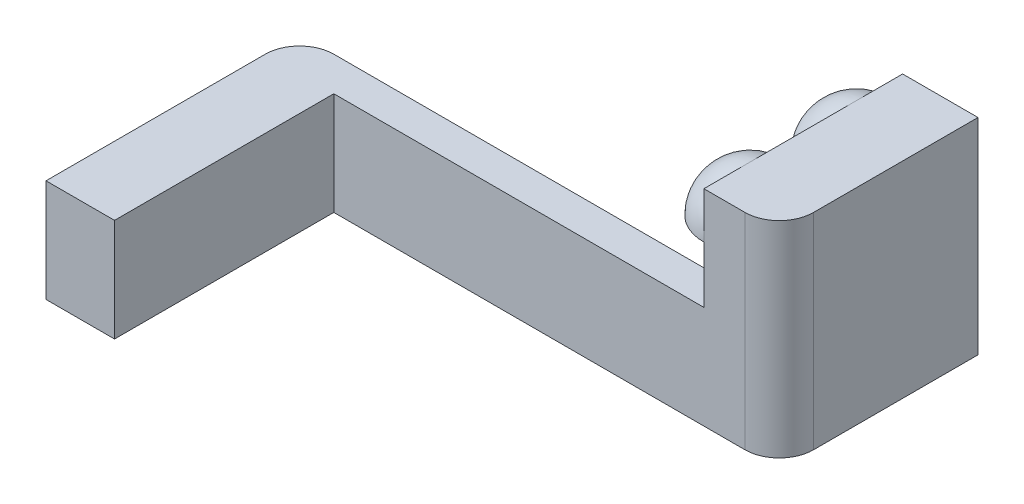
ISO-10303-21;
HEADER;
FILE_DESCRIPTION(('STEP AP214'),'2;1');
FILE_NAME('part.step','',(''),(''),'','','');
FILE_SCHEMA(('AUTOMOTIVE_DESIGN { 1 0 10303 214 1 1 1 1 }'));
ENDSEC;
DATA;
#1=APPLICATION_CONTEXT('core data for automotive mechanical design processes');
#2=APPLICATION_PROTOCOL_DEFINITION('international standard','automotive_design',2000,#1);
#3=PRODUCT_CONTEXT('',#1,'mechanical');
#4=PRODUCT('Part','Part','',(#3));
#5=PRODUCT_RELATED_PRODUCT_CATEGORY('part','',(#4));
#6=PRODUCT_DEFINITION_FORMATION('','',#4);
#7=PRODUCT_DEFINITION_CONTEXT('part definition',#1,'design');
#8=PRODUCT_DEFINITION('design','',#6,#7);
#9=PRODUCT_DEFINITION_SHAPE('','',#8);
#10=(LENGTH_UNIT() NAMED_UNIT(*) SI_UNIT(.MILLI.,.METRE.));
#11=(NAMED_UNIT(*) PLANE_ANGLE_UNIT() SI_UNIT($,.RADIAN.));
#12=(NAMED_UNIT(*) SI_UNIT($,.STERADIAN.) SOLID_ANGLE_UNIT());
#13=UNCERTAINTY_MEASURE_WITH_UNIT(LENGTH_MEASURE(1.E-05),#10,'distance_accuracy_value','');
#14=(GEOMETRIC_REPRESENTATION_CONTEXT(3) GLOBAL_UNCERTAINTY_ASSIGNED_CONTEXT((#13)) GLOBAL_UNIT_ASSIGNED_CONTEXT((#10,
#11,#12)) REPRESENTATION_CONTEXT('',''));
#15=CARTESIAN_POINT('',(0.,0.,0.));
#16=DIRECTION('',(0.,0.,1.));
#17=DIRECTION('',(1.,0.,0.));
#18=AXIS2_PLACEMENT_3D('',#15,#16,#17);
#19=CARTESIAN_POINT('',(24.,22.5,-123.594117081557));
#20=DIRECTION('',(1.,0.,0.));
#21=DIRECTION('',(0.,1.,0.));
#22=AXIS2_PLACEMENT_3D('',#19,#20,#21);
#23=PLANE('',#22);
#24=CARTESIAN_POINT('',(24.,15.75,-70.75));
#25=DIRECTION('',(1.,0.,0.));
#26=DIRECTION('',(0.,-1.,0.));
#27=AXIS2_PLACEMENT_3D('',#24,#25,#26);
#28=CIRCLE('',#27,6.75);
#29=CARTESIAN_POINT('',(24.,22.5,-70.75));
#30=VERTEX_POINT('',#29);
#31=CARTESIAN_POINT('',(24.,15.75,-64.));
#32=VERTEX_POINT('',#31);
#33=EDGE_CURVE('E200',#30,#32,#28,.T.);
#34=ORIENTED_EDGE('',*,*,#33,.T.);
#35=DIRECTION('',(0.,-1.,0.));
#36=VECTOR('',#35,1.);
#37=CARTESIAN_POINT('',(24.,22.5,-64.));
#38=LINE('',#37,#36);
#39=CARTESIAN_POINT('',(24.,22.5,-64.));
#40=VERTEX_POINT('',#39);
#41=EDGE_CURVE('E315',#40,#32,#38,.T.);
#42=ORIENTED_EDGE('',*,*,#41,.F.);
#43=DIRECTION('',(0.,0.,1.));
#44=VECTOR('',#43,1.);
#45=CARTESIAN_POINT('',(24.,22.5,-123.594117081557));
#46=LINE('',#45,#44);
#47=EDGE_CURVE('E328',#30,#40,#46,.T.);
#48=ORIENTED_EDGE('',*,*,#47,.F.);
#49=EDGE_LOOP('',(#34,#42,#48));
#50=FACE_BOUND('',#49,.T.);
#51=ADVANCED_FACE('F45',(#50),#23,.F.);
#52=CARTESIAN_POINT('',(24.,15.75,-77.5));
#53=VERTEX_POINT('',#52);
#54=EDGE_CURVE('E206',#53,#30,#28,.T.);
#55=ORIENTED_EDGE('',*,*,#54,.T.);
#56=CARTESIAN_POINT('',(24.,22.5,-86.25));
#57=VERTEX_POINT('',#56);
#58=EDGE_CURVE('E332',#57,#30,#46,.T.);
#59=ORIENTED_EDGE('',*,*,#58,.F.);
#60=CARTESIAN_POINT('',(24.,15.75,-86.25));
#61=DIRECTION('',(-1.,0.,0.));
#62=DIRECTION('',(0.,1.,0.));
#63=AXIS2_PLACEMENT_3D('',#60,#61,#62);
#64=CIRCLE('',#63,6.75);
#65=CARTESIAN_POINT('',(24.,15.75,-79.5));
#66=VERTEX_POINT('',#65);
#67=EDGE_CURVE('E11',#57,#66,#64,.F.);
#68=ORIENTED_EDGE('',*,*,#67,.T.);
#69=DIRECTION('',(0.,0.,-1.));
#70=VECTOR('',#69,1.);
#71=CARTESIAN_POINT('',(24.,15.75,-64.));
#72=LINE('',#71,#70);
#73=CARTESIAN_POINT('',(24.,15.75,-93.));
#74=VERTEX_POINT('',#73);
#75=EDGE_CURVE('E222',#66,#74,#72,.T.);
#76=ORIENTED_EDGE('',*,*,#75,.T.);
#77=DIRECTION('',(0.,1.,0.));
#78=VECTOR('',#77,1.);
#79=CARTESIAN_POINT('',(24.,22.5,-93.));
#80=LINE('',#79,#78);
#81=CARTESIAN_POINT('',(24.,-7.5,-93.));
#82=VERTEX_POINT('',#81);
#83=EDGE_CURVE('E319',#82,#74,#80,.T.);
#84=ORIENTED_EDGE('',*,*,#83,.F.);
#85=DIRECTION('',(0.,0.,1.));
#86=VECTOR('',#85,1.);
#87=CARTESIAN_POINT('',(24.,-7.5,-123.594117081557));
#88=LINE('',#87,#86);
#89=CARTESIAN_POINT('',(24.,-7.5,-69.));
#90=VERTEX_POINT('',#89);
#91=EDGE_CURVE('E318',#82,#90,#88,.T.);
#92=ORIENTED_EDGE('',*,*,#91,.T.);
#93=DIRECTION('',(0.,-1.,0.));
#94=VECTOR('',#93,1.);
#95=CARTESIAN_POINT('',(24.,0.,-69.));
#96=LINE('',#95,#94);
#97=CARTESIAN_POINT('',(24.,7.5,-69.));
#98=VERTEX_POINT('',#97);
#99=EDGE_CURVE('E323',#98,#90,#96,.T.);
#100=ORIENTED_EDGE('',*,*,#99,.F.);
#101=DIRECTION('',(0.,0.,-1.));
#102=VECTOR('',#101,1.);
#103=CARTESIAN_POINT('',(24.,7.5,-69.));
#104=LINE('',#103,#102);
#105=CARTESIAN_POINT('',(24.,7.5,-64.));
#106=VERTEX_POINT('',#105);
#107=EDGE_CURVE('E336',#106,#98,#104,.T.);
#108=ORIENTED_EDGE('',*,*,#107,.F.);
#109=EDGE_CURVE('E210',#32,#106,#38,.T.);
#110=ORIENTED_EDGE('',*,*,#109,.F.);
#111=DIRECTION('',(0.,0.,-1.));
#112=VECTOR('',#111,1.);
#113=CARTESIAN_POINT('',(24.,15.75,-64.));
#114=LINE('',#113,#112);
#115=EDGE_CURVE('E197',#32,#53,#114,.T.);
#116=ORIENTED_EDGE('',*,*,#115,.T.);
#117=EDGE_LOOP('',(#55,#59,#68,#76,#84,#92,#100,#108,#110,#116));
#118=FACE_BOUND('',#117,.T.);
#119=ADVANCED_FACE('F204',(#118),#23,.F.);
#120=CARTESIAN_POINT('',(24.,15.75,-86.25));
#121=DIRECTION('',(1.,0.,0.));
#122=DIRECTION('',(0.,-1.,0.));
#123=AXIS2_PLACEMENT_3D('',#120,#121,#122);
#124=CIRCLE('',#123,6.75);
#125=EDGE_CURVE('E217',#74,#57,#124,.T.);
#126=ORIENTED_EDGE('',*,*,#125,.T.);
#127=CARTESIAN_POINT('',(24.,22.5,-93.));
#128=VERTEX_POINT('',#127);
#129=EDGE_CURVE('E329',#128,#57,#46,.T.);
#130=ORIENTED_EDGE('',*,*,#129,.F.);
#131=EDGE_CURVE('E324',#74,#128,#80,.T.);
#132=ORIENTED_EDGE('',*,*,#131,.F.);
#133=EDGE_LOOP('',(#126,#130,#132));
#134=FACE_BOUND('',#133,.T.);
#135=ADVANCED_FACE('F478',(#134),#23,.F.);
#136=CARTESIAN_POINT('',(30.,7.5,-69.));
#137=DIRECTION('',(0.,-1.,0.));
#138=DIRECTION('',(1.,0.,0.));
#139=AXIS2_PLACEMENT_3D('',#136,#137,#138);
#140=PLANE('',#139);
#141=ORIENTED_EDGE('',*,*,#107,.T.);
#142=DIRECTION('',(-1.,0.,0.));
#143=VECTOR('',#142,1.);
#144=CARTESIAN_POINT('',(30.,7.5,-69.));
#145=LINE('',#144,#143);
#146=CARTESIAN_POINT('',(-35.,7.5,-69.));
#147=VERTEX_POINT('',#146);
#148=EDGE_CURVE('E395',#98,#147,#145,.T.);
#149=ORIENTED_EDGE('',*,*,#148,.T.);
#150=CARTESIAN_POINT('',(-35.,7.5,-64.));
#151=DIRECTION('',(0.,1.,0.));
#152=DIRECTION('',(1.,0.,0.));
#153=AXIS2_PLACEMENT_3D('',#150,#151,#152);
#154=CIRCLE('',#153,5.);
#155=CARTESIAN_POINT('',(-40.,7.5,-64.));
#156=VERTEX_POINT('',#155);
#157=EDGE_CURVE('E412',#156,#147,#154,.F.);
#158=ORIENTED_EDGE('',*,*,#157,.F.);
#159=DIRECTION('',(0.,0.,1.));
#160=VECTOR('',#159,1.);
#161=CARTESIAN_POINT('',(-40.,7.5,-69.));
#162=LINE('',#161,#160);
#163=CARTESIAN_POINT('',(-40.,7.49999999999999,-32.));
#164=VERTEX_POINT('',#163);
#165=EDGE_CURVE('E362',#156,#164,#162,.T.);
#166=ORIENTED_EDGE('',*,*,#165,.T.);
#167=DIRECTION('',(1.,0.,0.));
#168=VECTOR('',#167,1.);
#169=CARTESIAN_POINT('',(-40.,7.49999999999999,-32.));
#170=LINE('',#169,#168);
#171=CARTESIAN_POINT('',(-30.,7.49999999999999,-32.));
#172=VERTEX_POINT('',#171);
#173=EDGE_CURVE('E387',#164,#172,#170,.T.);
#174=ORIENTED_EDGE('',*,*,#173,.T.);
#175=DIRECTION('',(0.,0.,1.));
#176=VECTOR('',#175,1.);
#177=CARTESIAN_POINT('',(-30.,7.5,-69.));
#178=LINE('',#177,#176);
#179=CARTESIAN_POINT('',(-30.,7.5,-64.));
#180=VERTEX_POINT('',#179);
#181=EDGE_CURVE('E361',#180,#172,#178,.T.);
#182=ORIENTED_EDGE('',*,*,#181,.F.);
#183=DIRECTION('',(-1.,0.,0.));
#184=VECTOR('',#183,1.);
#185=CARTESIAN_POINT('',(30.,7.5,-64.));
#186=LINE('',#185,#184);
#187=EDGE_CURVE('E396',#106,#180,#186,.T.);
#188=ORIENTED_EDGE('',*,*,#187,.F.);
#189=EDGE_LOOP('',(#141,#149,#158,#166,#174,#182,#188));
#190=FACE_BOUND('',#189,.T.);
#191=ADVANCED_FACE('F483',(#190),#140,.F.);
#192=CARTESIAN_POINT('',(0.,0.,-69.));
#193=DIRECTION('',(0.,0.,1.));
#194=DIRECTION('',(-1.,0.,0.));
#195=AXIS2_PLACEMENT_3D('',#192,#193,#194);
#196=PLANE('',#195);
#197=ORIENTED_EDGE('',*,*,#99,.T.);
#198=DIRECTION('',(1.,0.,0.));
#199=VECTOR('',#198,1.);
#200=CARTESIAN_POINT('',(30.,-7.5,-69.));
#201=LINE('',#200,#199);
#202=CARTESIAN_POINT('',(-35.,-7.5,-69.));
#203=VERTEX_POINT('',#202);
#204=EDGE_CURVE('E392',#203,#90,#201,.T.);
#205=ORIENTED_EDGE('',*,*,#204,.F.);
#206=DIRECTION('',(0.,1.,0.));
#207=VECTOR('',#206,1.);
#208=CARTESIAN_POINT('',(-35.,0.,-69.));
#209=LINE('',#208,#207);
#210=EDGE_CURVE('E416',#147,#203,#209,.F.);
#211=ORIENTED_EDGE('',*,*,#210,.F.);
#212=ORIENTED_EDGE('',*,*,#148,.F.);
#213=EDGE_LOOP('',(#197,#205,#211,#212));
#214=FACE_BOUND('',#213,.T.);
#215=ADVANCED_FACE('F469',(#214),#196,.F.);
#216=CARTESIAN_POINT('',(30.,-7.5,-69.));
#217=DIRECTION('',(0.,1.,0.));
#218=DIRECTION('',(-1.,0.,0.));
#219=AXIS2_PLACEMENT_3D('',#216,#217,#218);
#220=PLANE('',#219);
#221=DIRECTION('',(1.,0.,0.));
#222=VECTOR('',#221,1.);
#223=CARTESIAN_POINT('',(33.,-7.5,-69.));
#224=LINE('',#223,#222);
#225=CARTESIAN_POINT('',(27.,-7.5,-69.));
#226=VERTEX_POINT('',#225);
#227=CARTESIAN_POINT('',(33.,-7.5,-69.));
#228=VERTEX_POINT('',#227);
#229=EDGE_CURVE('E250',#226,#228,#224,.T.);
#230=ORIENTED_EDGE('',*,*,#229,.T.);
#231=DIRECTION('',(0.,0.,-1.));
#232=VECTOR('',#231,1.);
#233=CARTESIAN_POINT('',(33.,-7.5,-91.));
#234=LINE('',#233,#232);
#235=CARTESIAN_POINT('',(33.,-7.5,-91.));
#236=VERTEX_POINT('',#235);
#237=EDGE_CURVE('E255',#228,#236,#234,.T.);
#238=ORIENTED_EDGE('',*,*,#237,.T.);
#239=DIRECTION('',(-1.,0.,0.));
#240=VECTOR('',#239,1.);
#241=CARTESIAN_POINT('',(33.,-7.5,-91.));
#242=LINE('',#241,#240);
#243=CARTESIAN_POINT('',(27.,-7.5,-91.));
#244=VERTEX_POINT('',#243);
#245=EDGE_CURVE('E236',#236,#244,#242,.T.);
#246=ORIENTED_EDGE('',*,*,#245,.T.);
#247=DIRECTION('',(0.,0.,1.));
#248=VECTOR('',#247,1.);
#249=CARTESIAN_POINT('',(27.,-7.5,-91.));
#250=LINE('',#249,#248);
#251=EDGE_CURVE('E246',#244,#226,#250,.T.);
#252=ORIENTED_EDGE('',*,*,#251,.T.);
#253=EDGE_LOOP('',(#230,#238,#246,#252));
#254=FACE_BOUND('',#253,.T.);
#255=DIRECTION('',(1.,0.,0.));
#256=VECTOR('',#255,1.);
#257=CARTESIAN_POINT('',(-32.,-7.5,-37.));
#258=LINE('',#257,#256);
#259=CARTESIAN_POINT('',(-38.,-7.5,-37.));
#260=VERTEX_POINT('',#259);
#261=CARTESIAN_POINT('',(-32.,-7.5,-37.));
#262=VERTEX_POINT('',#261);
#263=EDGE_CURVE('E295',#260,#262,#258,.T.);
#264=ORIENTED_EDGE('',*,*,#263,.T.);
#265=DIRECTION('',(0.,0.,-1.));
#266=VECTOR('',#265,1.);
#267=CARTESIAN_POINT('',(-32.,-7.5,-59.));
#268=LINE('',#267,#266);
#269=CARTESIAN_POINT('',(-32.,-7.5,-59.));
#270=VERTEX_POINT('',#269);
#271=EDGE_CURVE('E290',#262,#270,#268,.T.);
#272=ORIENTED_EDGE('',*,*,#271,.T.);
#273=DIRECTION('',(-1.,0.,0.));
#274=VECTOR('',#273,1.);
#275=CARTESIAN_POINT('',(-32.,-7.5,-59.));
#276=LINE('',#275,#274);
#277=CARTESIAN_POINT('',(-38.,-7.5,-59.));
#278=VERTEX_POINT('',#277);
#279=EDGE_CURVE('E286',#270,#278,#276,.T.);
#280=ORIENTED_EDGE('',*,*,#279,.T.);
#281=DIRECTION('',(0.,0.,1.));
#282=VECTOR('',#281,1.);
#283=CARTESIAN_POINT('',(-38.,-7.5,-59.));
#284=LINE('',#283,#282);
#285=EDGE_CURVE('E251',#278,#260,#284,.T.);
#286=ORIENTED_EDGE('',*,*,#285,.T.);
#287=EDGE_LOOP('',(#264,#272,#280,#286));
#288=FACE_BOUND('',#287,.T.);
#289=DIRECTION('',(1.,0.,0.));
#290=VECTOR('',#289,1.);
#291=CARTESIAN_POINT('',(30.,-7.5,-64.));
#292=LINE('',#291,#290);
#293=CARTESIAN_POINT('',(-30.,-7.50000000000001,-64.));
#294=VERTEX_POINT('',#293);
#295=CARTESIAN_POINT('',(30.,-7.5,-64.));
#296=VERTEX_POINT('',#295);
#297=EDGE_CURVE('E403',#294,#296,#292,.T.);
#298=ORIENTED_EDGE('',*,*,#297,.F.);
#299=DIRECTION('',(0.,0.,-1.));
#300=VECTOR('',#299,1.);
#301=CARTESIAN_POINT('',(-30.,-7.50000000000001,-69.));
#302=LINE('',#301,#300);
#303=CARTESIAN_POINT('',(-30.,-7.50000000000001,-32.));
#304=VERTEX_POINT('',#303);
#305=EDGE_CURVE('E367',#304,#294,#302,.T.);
#306=ORIENTED_EDGE('',*,*,#305,.F.);
#307=DIRECTION('',(1.,0.,0.));
#308=VECTOR('',#307,1.);
#309=CARTESIAN_POINT('',(-40.,-7.50000000000001,-32.));
#310=LINE('',#309,#308);
#311=CARTESIAN_POINT('',(-40.,-7.50000000000001,-32.));
#312=VERTEX_POINT('',#311);
#313=EDGE_CURVE('E374',#312,#304,#310,.T.);
#314=ORIENTED_EDGE('',*,*,#313,.F.);
#315=DIRECTION('',(0.,0.,-1.));
#316=VECTOR('',#315,1.);
#317=CARTESIAN_POINT('',(-40.,-7.50000000000001,-69.));
#318=LINE('',#317,#316);
#319=CARTESIAN_POINT('',(-40.,-7.50000000000001,-64.));
#320=VERTEX_POINT('',#319);
#321=EDGE_CURVE('E370',#312,#320,#318,.T.);
#322=ORIENTED_EDGE('',*,*,#321,.T.);
#323=CARTESIAN_POINT('',(-35.,-7.5,-64.));
#324=DIRECTION('',(0.,-1.,0.));
#325=DIRECTION('',(-1.,0.,0.));
#326=AXIS2_PLACEMENT_3D('',#323,#324,#325);
#327=CIRCLE('',#326,5.);
#328=EDGE_CURVE('E420',#203,#320,#327,.F.);
#329=ORIENTED_EDGE('',*,*,#328,.F.);
#330=ORIENTED_EDGE('',*,*,#204,.T.);
#331=ORIENTED_EDGE('',*,*,#91,.F.);
#332=DIRECTION('',(-1.,0.,0.));
#333=VECTOR('',#332,1.);
#334=CARTESIAN_POINT('',(35.,-7.50000000000001,-93.));
#335=LINE('',#334,#333);
#336=CARTESIAN_POINT('',(35.,-7.50000000000001,-93.));
#337=VERTEX_POINT('',#336);
#338=EDGE_CURVE('E352',#337,#82,#335,.T.);
#339=ORIENTED_EDGE('',*,*,#338,.F.);
#340=DIRECTION('',(0.,0.,1.));
#341=VECTOR('',#340,1.);
#342=CARTESIAN_POINT('',(35.,-7.5,-64.));
#343=LINE('',#342,#341);
#344=CARTESIAN_POINT('',(35.,-7.5,-69.));
#345=VERTEX_POINT('',#344);
#346=EDGE_CURVE('E348',#337,#345,#343,.T.);
#347=ORIENTED_EDGE('',*,*,#346,.T.);
#348=CARTESIAN_POINT('',(30.,-7.5,-69.));
#349=DIRECTION('',(0.,-1.,0.));
#350=DIRECTION('',(-1.,0.,0.));
#351=AXIS2_PLACEMENT_3D('',#348,#349,#350);
#352=CIRCLE('',#351,5.);
#353=EDGE_CURVE('E54',#296,#345,#352,.F.);
#354=ORIENTED_EDGE('',*,*,#353,.F.);
#355=EDGE_LOOP('',(#298,#306,#314,#322,#329,#330,#331,#339,#347,#354));
#356=FACE_BOUND('',#355,.T.);
#357=ADVANCED_FACE('F438',(#254,#288,#356),#220,.F.);
#358=CARTESIAN_POINT('',(0.,0.,-64.));
#359=DIRECTION('',(0.,0.,1.));
#360=DIRECTION('',(-1.,0.,0.));
#361=AXIS2_PLACEMENT_3D('',#358,#359,#360);
#362=PLANE('',#361);
#363=DIRECTION('',(0.,1.,0.));
#364=VECTOR('',#363,1.);
#365=CARTESIAN_POINT('',(30.,22.5,-64.));
#366=LINE('',#365,#364);
#367=CARTESIAN_POINT('',(30.,22.5,-64.));
#368=VERTEX_POINT('',#367);
#369=EDGE_CURVE('E340',#296,#368,#366,.T.);
#370=ORIENTED_EDGE('',*,*,#369,.T.);
#371=DIRECTION('',(-1.,0.,0.));
#372=VECTOR('',#371,1.);
#373=CARTESIAN_POINT('',(30.,22.5,-64.));
#374=LINE('',#373,#372);
#375=EDGE_CURVE('E265',#368,#40,#374,.T.);
#376=ORIENTED_EDGE('',*,*,#375,.T.);
#377=ORIENTED_EDGE('',*,*,#41,.T.);
#378=ORIENTED_EDGE('',*,*,#109,.T.);
#379=ORIENTED_EDGE('',*,*,#187,.T.);
#380=DIRECTION('',(0.,-1.,0.));
#381=VECTOR('',#380,1.);
#382=CARTESIAN_POINT('',(-30.,7.5,-64.));
#383=LINE('',#382,#381);
#384=EDGE_CURVE('E391',#180,#294,#383,.T.);
#385=ORIENTED_EDGE('',*,*,#384,.T.);
#386=ORIENTED_EDGE('',*,*,#297,.T.);
#387=EDGE_LOOP('',(#370,#376,#377,#378,#379,#385,#386));
#388=FACE_BOUND('',#387,.T.);
#389=ADVANCED_FACE('F451',(#388),#362,.T.);
#390=CARTESIAN_POINT('',(-40.,7.49999999999999,-32.));
#391=DIRECTION('',(0.,0.,-1.));
#392=DIRECTION('',(1.,0.,0.));
#393=AXIS2_PLACEMENT_3D('',#390,#391,#392);
#394=PLANE('',#393);
#395=DIRECTION('',(0.,-1.,0.));
#396=VECTOR('',#395,1.);
#397=CARTESIAN_POINT('',(-30.,7.49999999999999,-32.));
#398=LINE('',#397,#396);
#399=EDGE_CURVE('E378',#172,#304,#398,.T.);
#400=ORIENTED_EDGE('',*,*,#399,.F.);
#401=ORIENTED_EDGE('',*,*,#173,.F.);
#402=DIRECTION('',(0.,-1.,0.));
#403=VECTOR('',#402,1.);
#404=CARTESIAN_POINT('',(-40.,7.49999999999999,-32.));
#405=LINE('',#404,#403);
#406=EDGE_CURVE('E366',#164,#312,#405,.T.);
#407=ORIENTED_EDGE('',*,*,#406,.T.);
#408=ORIENTED_EDGE('',*,*,#313,.T.);
#409=EDGE_LOOP('',(#400,#401,#407,#408));
#410=FACE_BOUND('',#409,.T.);
#411=ADVANCED_FACE('F459',(#410),#394,.F.);
#412=CARTESIAN_POINT('',(-40.,0.,-64.));
#413=DIRECTION('',(1.,0.,0.));
#414=DIRECTION('',(0.,0.,1.));
#415=AXIS2_PLACEMENT_3D('',#412,#413,#414);
#416=PLANE('',#415);
#417=ORIENTED_EDGE('',*,*,#321,.F.);
#418=ORIENTED_EDGE('',*,*,#406,.F.);
#419=ORIENTED_EDGE('',*,*,#165,.F.);
#420=DIRECTION('',(0.,1.,0.));
#421=VECTOR('',#420,1.);
#422=CARTESIAN_POINT('',(-40.,0.,-64.));
#423=LINE('',#422,#421);
#424=EDGE_CURVE('E400',#320,#156,#423,.T.);
#425=ORIENTED_EDGE('',*,*,#424,.F.);
#426=EDGE_LOOP('',(#417,#418,#419,#425));
#427=FACE_BOUND('',#426,.T.);
#428=ADVANCED_FACE('F463',(#427),#416,.F.);
#429=CARTESIAN_POINT('',(-30.,0.,-64.));
#430=DIRECTION('',(1.,0.,0.));
#431=DIRECTION('',(0.,0.,1.));
#432=AXIS2_PLACEMENT_3D('',#429,#430,#431);
#433=PLANE('',#432);
#434=ORIENTED_EDGE('',*,*,#181,.T.);
#435=ORIENTED_EDGE('',*,*,#399,.T.);
#436=ORIENTED_EDGE('',*,*,#305,.T.);
#437=ORIENTED_EDGE('',*,*,#384,.F.);
#438=EDGE_LOOP('',(#434,#435,#436,#437));
#439=FACE_BOUND('',#438,.T.);
#440=ADVANCED_FACE('F455',(#439),#433,.T.);
#441=CARTESIAN_POINT('',(-35.,0.,-64.));
#442=DIRECTION('',(0.,1.,0.));
#443=DIRECTION('',(0.,0.,-1.));
#444=AXIS2_PLACEMENT_3D('',#441,#442,#443);
#445=CYLINDRICAL_SURFACE('',#444,5.);
#446=ORIENTED_EDGE('',*,*,#328,.T.);
#447=ORIENTED_EDGE('',*,*,#424,.T.);
#448=ORIENTED_EDGE('',*,*,#157,.T.);
#449=ORIENTED_EDGE('',*,*,#210,.T.);
#450=EDGE_LOOP('',(#446,#447,#448,#449));
#451=FACE_BOUND('',#450,.T.);
#452=ADVANCED_FACE('F466',(#451),#445,.T.);
#453=CARTESIAN_POINT('',(35.,22.5,-64.));
#454=DIRECTION('',(0.,-1.,0.));
#455=DIRECTION('',(0.,0.,1.));
#456=AXIS2_PLACEMENT_3D('',#453,#454,#455);
#457=PLANE('',#456);
#458=DIRECTION('',(0.,0.,-1.));
#459=VECTOR('',#458,1.);
#460=CARTESIAN_POINT('',(35.,22.5,-64.));
#461=LINE('',#460,#459);
#462=CARTESIAN_POINT('',(35.,22.5,-69.));
#463=VERTEX_POINT('',#462);
#464=CARTESIAN_POINT('',(35.,22.5,-93.));
#465=VERTEX_POINT('',#464);
#466=EDGE_CURVE('E341',#463,#465,#461,.T.);
#467=ORIENTED_EDGE('',*,*,#466,.T.);
#468=DIRECTION('',(-1.,0.,0.));
#469=VECTOR('',#468,1.);
#470=CARTESIAN_POINT('',(35.,22.5,-93.));
#471=LINE('',#470,#469);
#472=EDGE_CURVE('E358',#465,#128,#471,.T.);
#473=ORIENTED_EDGE('',*,*,#472,.T.);
#474=ORIENTED_EDGE('',*,*,#129,.T.);
#475=ORIENTED_EDGE('',*,*,#58,.T.);
#476=ORIENTED_EDGE('',*,*,#47,.T.);
#477=ORIENTED_EDGE('',*,*,#375,.F.);
#478=CARTESIAN_POINT('',(30.,22.5,-69.));
#479=DIRECTION('',(0.,1.,0.));
#480=DIRECTION('',(0.,0.,1.));
#481=AXIS2_PLACEMENT_3D('',#478,#479,#480);
#482=CIRCLE('',#481,5.);
#483=EDGE_CURVE('E427',#463,#368,#482,.F.);
#484=ORIENTED_EDGE('',*,*,#483,.F.);
#485=EDGE_LOOP('',(#467,#473,#474,#475,#476,#477,#484));
#486=FACE_BOUND('',#485,.T.);
#487=ADVANCED_FACE('F445',(#486),#457,.F.);
#488=CARTESIAN_POINT('',(35.,22.5,-93.));
#489=DIRECTION('',(0.,0.,1.));
#490=DIRECTION('',(0.,1.,0.));
#491=AXIS2_PLACEMENT_3D('',#488,#489,#490);
#492=PLANE('',#491);
#493=ORIENTED_EDGE('',*,*,#472,.F.);
#494=DIRECTION('',(0.,-1.,0.));
#495=VECTOR('',#494,1.);
#496=CARTESIAN_POINT('',(35.,22.5,-93.));
#497=LINE('',#496,#495);
#498=EDGE_CURVE('E345',#465,#337,#497,.T.);
#499=ORIENTED_EDGE('',*,*,#498,.T.);
#500=ORIENTED_EDGE('',*,*,#338,.T.);
#501=ORIENTED_EDGE('',*,*,#83,.T.);
#502=ORIENTED_EDGE('',*,*,#131,.T.);
#503=EDGE_LOOP('',(#493,#499,#500,#501,#502));
#504=FACE_BOUND('',#503,.T.);
#505=ADVANCED_FACE('F473',(#504),#492,.F.);
#506=CARTESIAN_POINT('',(35.,0.,-64.));
#507=DIRECTION('',(-1.,0.,0.));
#508=DIRECTION('',(0.,0.,-1.));
#509=AXIS2_PLACEMENT_3D('',#506,#507,#508);
#510=PLANE('',#509);
#511=ORIENTED_EDGE('',*,*,#346,.F.);
#512=ORIENTED_EDGE('',*,*,#498,.F.);
#513=ORIENTED_EDGE('',*,*,#466,.F.);
#514=DIRECTION('',(0.,1.,0.));
#515=VECTOR('',#514,1.);
#516=CARTESIAN_POINT('',(35.,22.5,-69.));
#517=LINE('',#516,#515);
#518=EDGE_CURVE('E424',#345,#463,#517,.T.);
#519=ORIENTED_EDGE('',*,*,#518,.F.);
#520=EDGE_LOOP('',(#511,#512,#513,#519));
#521=FACE_BOUND('',#520,.T.);
#522=ADVANCED_FACE('F441',(#521),#510,.F.);
#523=CARTESIAN_POINT('',(30.,0.,-69.));
#524=DIRECTION('',(0.,-1.,0.));
#525=DIRECTION('',(0.,0.,1.));
#526=AXIS2_PLACEMENT_3D('',#523,#524,#525);
#527=CYLINDRICAL_SURFACE('',#526,5.);
#528=ORIENTED_EDGE('',*,*,#353,.T.);
#529=ORIENTED_EDGE('',*,*,#518,.T.);
#530=ORIENTED_EDGE('',*,*,#483,.T.);
#531=ORIENTED_EDGE('',*,*,#369,.F.);
#532=EDGE_LOOP('',(#528,#529,#530,#531));
#533=FACE_BOUND('',#532,.T.);
#534=ADVANCED_FACE('F47',(#533),#527,.T.);
#535=CARTESIAN_POINT('',(-38.,3.5,-59.));
#536=DIRECTION('',(-1.,0.,0.));
#537=DIRECTION('',(0.,-1.,0.));
#538=AXIS2_PLACEMENT_3D('',#535,#536,#537);
#539=PLANE('',#538);
#540=ORIENTED_EDGE('',*,*,#285,.F.);
#541=DIRECTION('',(0.,-1.,0.));
#542=VECTOR('',#541,1.);
#543=CARTESIAN_POINT('',(-38.,3.5,-59.));
#544=LINE('',#543,#542);
#545=CARTESIAN_POINT('',(-38.,3.5,-59.));
#546=VERTEX_POINT('',#545);
#547=EDGE_CURVE('E230',#546,#278,#544,.T.);
#548=ORIENTED_EDGE('',*,*,#547,.F.);
#549=DIRECTION('',(0.,0.,1.));
#550=VECTOR('',#549,1.);
#551=CARTESIAN_POINT('',(-38.,3.5,-59.));
#552=LINE('',#551,#550);
#553=CARTESIAN_POINT('',(-38.,3.5,-37.));
#554=VERTEX_POINT('',#553);
#555=EDGE_CURVE('E291',#546,#554,#552,.T.);
#556=ORIENTED_EDGE('',*,*,#555,.T.);
#557=DIRECTION('',(0.,-1.,0.));
#558=VECTOR('',#557,1.);
#559=CARTESIAN_POINT('',(-38.,3.5,-37.));
#560=LINE('',#559,#558);
#561=EDGE_CURVE('E274',#554,#260,#560,.T.);
#562=ORIENTED_EDGE('',*,*,#561,.T.);
#563=EDGE_LOOP('',(#540,#548,#556,#562));
#564=FACE_BOUND('',#563,.T.);
#565=ADVANCED_FACE('F545',(#564),#539,.F.);
#566=CARTESIAN_POINT('',(-32.,3.5,-59.));
#567=DIRECTION('',(0.,0.,-1.));
#568=DIRECTION('',(1.,0.,0.));
#569=AXIS2_PLACEMENT_3D('',#566,#567,#568);
#570=PLANE('',#569);
#571=ORIENTED_EDGE('',*,*,#279,.F.);
#572=DIRECTION('',(0.,-1.,0.));
#573=VECTOR('',#572,1.);
#574=CARTESIAN_POINT('',(-32.,3.5,-59.));
#575=LINE('',#574,#573);
#576=CARTESIAN_POINT('',(-32.,3.5,-59.));
#577=VERTEX_POINT('',#576);
#578=EDGE_CURVE('E281',#577,#270,#575,.T.);
#579=ORIENTED_EDGE('',*,*,#578,.F.);
#580=DIRECTION('',(-1.,0.,0.));
#581=VECTOR('',#580,1.);
#582=CARTESIAN_POINT('',(-32.,3.5,-59.));
#583=LINE('',#582,#581);
#584=EDGE_CURVE('E277',#577,#546,#583,.T.);
#585=ORIENTED_EDGE('',*,*,#584,.T.);
#586=ORIENTED_EDGE('',*,*,#547,.T.);
#587=EDGE_LOOP('',(#571,#579,#585,#586));
#588=FACE_BOUND('',#587,.T.);
#589=ADVANCED_FACE('F551',(#588),#570,.F.);
#590=CARTESIAN_POINT('',(-32.,3.5,-59.));
#591=DIRECTION('',(1.,0.,0.));
#592=DIRECTION('',(0.,1.,0.));
#593=AXIS2_PLACEMENT_3D('',#590,#591,#592);
#594=PLANE('',#593);
#595=ORIENTED_EDGE('',*,*,#271,.F.);
#596=DIRECTION('',(0.,-1.,0.));
#597=VECTOR('',#596,1.);
#598=CARTESIAN_POINT('',(-32.,3.5,-37.));
#599=LINE('',#598,#597);
#600=CARTESIAN_POINT('',(-32.,3.5,-37.));
#601=VERTEX_POINT('',#600);
#602=EDGE_CURVE('E278',#601,#262,#599,.T.);
#603=ORIENTED_EDGE('',*,*,#602,.F.);
#604=DIRECTION('',(0.,0.,-1.));
#605=VECTOR('',#604,1.);
#606=CARTESIAN_POINT('',(-32.,3.5,-59.));
#607=LINE('',#606,#605);
#608=EDGE_CURVE('E304',#601,#577,#607,.T.);
#609=ORIENTED_EDGE('',*,*,#608,.T.);
#610=ORIENTED_EDGE('',*,*,#578,.T.);
#611=EDGE_LOOP('',(#595,#603,#609,#610));
#612=FACE_BOUND('',#611,.T.);
#613=ADVANCED_FACE('F559',(#612),#594,.F.);
#614=CARTESIAN_POINT('',(-32.,3.5,-37.));
#615=DIRECTION('',(0.,0.,1.));
#616=DIRECTION('',(-1.,0.,0.));
#617=AXIS2_PLACEMENT_3D('',#614,#615,#616);
#618=PLANE('',#617);
#619=ORIENTED_EDGE('',*,*,#263,.F.);
#620=ORIENTED_EDGE('',*,*,#561,.F.);
#621=DIRECTION('',(1.,0.,0.));
#622=VECTOR('',#621,1.);
#623=CARTESIAN_POINT('',(-32.,3.5,-37.));
#624=LINE('',#623,#622);
#625=EDGE_CURVE('E307',#554,#601,#624,.T.);
#626=ORIENTED_EDGE('',*,*,#625,.T.);
#627=ORIENTED_EDGE('',*,*,#602,.T.);
#628=EDGE_LOOP('',(#619,#620,#626,#627));
#629=FACE_BOUND('',#628,.T.);
#630=ADVANCED_FACE('F566',(#629),#618,.F.);
#631=CARTESIAN_POINT('',(0.,3.5,-64.));
#632=DIRECTION('',(0.,1.,0.));
#633=DIRECTION('',(-1.,0.,0.));
#634=AXIS2_PLACEMENT_3D('',#631,#632,#633);
#635=PLANE('',#634);
#636=ORIENTED_EDGE('',*,*,#555,.F.);
#637=ORIENTED_EDGE('',*,*,#584,.F.);
#638=ORIENTED_EDGE('',*,*,#608,.F.);
#639=ORIENTED_EDGE('',*,*,#625,.F.);
#640=EDGE_LOOP('',(#636,#637,#638,#639));
#641=FACE_BOUND('',#640,.T.);
#642=ADVANCED_FACE('F501',(#641),#635,.F.);
#643=CARTESIAN_POINT('',(27.,3.5,-91.));
#644=DIRECTION('',(-1.,0.,0.));
#645=DIRECTION('',(0.,-1.,0.));
#646=AXIS2_PLACEMENT_3D('',#643,#644,#645);
#647=PLANE('',#646);
#648=ORIENTED_EDGE('',*,*,#251,.F.);
#649=DIRECTION('',(0.,-1.,0.));
#650=VECTOR('',#649,1.);
#651=CARTESIAN_POINT('',(27.,3.5,-91.));
#652=LINE('',#651,#650);
#653=CARTESIAN_POINT('',(27.,3.5,-91.));
#654=VERTEX_POINT('',#653);
#655=EDGE_CURVE('E262',#654,#244,#652,.T.);
#656=ORIENTED_EDGE('',*,*,#655,.F.);
#657=DIRECTION('',(0.,0.,1.));
#658=VECTOR('',#657,1.);
#659=CARTESIAN_POINT('',(27.,3.5,-91.));
#660=LINE('',#659,#658);
#661=CARTESIAN_POINT('',(27.,3.5,-69.));
#662=VERTEX_POINT('',#661);
#663=EDGE_CURVE('E231',#654,#662,#660,.T.);
#664=ORIENTED_EDGE('',*,*,#663,.T.);
#665=DIRECTION('',(0.,-1.,0.));
#666=VECTOR('',#665,1.);
#667=CARTESIAN_POINT('',(27.,3.5,-69.));
#668=LINE('',#667,#666);
#669=EDGE_CURVE('E245',#662,#226,#668,.T.);
#670=ORIENTED_EDGE('',*,*,#669,.T.);
#671=EDGE_LOOP('',(#648,#656,#664,#670));
#672=FACE_BOUND('',#671,.T.);
#673=ADVANCED_FACE('F581',(#672),#647,.F.);
#674=CARTESIAN_POINT('',(33.,3.5,-91.));
#675=DIRECTION('',(0.,0.,-1.));
#676=DIRECTION('',(1.,0.,0.));
#677=AXIS2_PLACEMENT_3D('',#674,#675,#676);
#678=PLANE('',#677);
#679=ORIENTED_EDGE('',*,*,#245,.F.);
#680=DIRECTION('',(0.,-1.,0.));
#681=VECTOR('',#680,1.);
#682=CARTESIAN_POINT('',(33.,3.5,-91.));
#683=LINE('',#682,#681);
#684=CARTESIAN_POINT('',(33.,3.5,-91.));
#685=VERTEX_POINT('',#684);
#686=EDGE_CURVE('E266',#685,#236,#683,.T.);
#687=ORIENTED_EDGE('',*,*,#686,.F.);
#688=DIRECTION('',(-1.,0.,0.));
#689=VECTOR('',#688,1.);
#690=CARTESIAN_POINT('',(33.,3.5,-91.));
#691=LINE('',#690,#689);
#692=EDGE_CURVE('E242',#685,#654,#691,.T.);
#693=ORIENTED_EDGE('',*,*,#692,.T.);
#694=ORIENTED_EDGE('',*,*,#655,.T.);
#695=EDGE_LOOP('',(#679,#687,#693,#694));
#696=FACE_BOUND('',#695,.T.);
#697=ADVANCED_FACE('F588',(#696),#678,.F.);
#698=CARTESIAN_POINT('',(33.,3.5,-91.));
#699=DIRECTION('',(1.,0.,0.));
#700=DIRECTION('',(0.,0.,1.));
#701=AXIS2_PLACEMENT_3D('',#698,#699,#700);
#702=PLANE('',#701);
#703=ORIENTED_EDGE('',*,*,#237,.F.);
#704=DIRECTION('',(0.,-1.,0.));
#705=VECTOR('',#704,1.);
#706=CARTESIAN_POINT('',(33.,3.5,-69.));
#707=LINE('',#706,#705);
#708=CARTESIAN_POINT('',(33.,3.5,-69.));
#709=VERTEX_POINT('',#708);
#710=EDGE_CURVE('E269',#709,#228,#707,.T.);
#711=ORIENTED_EDGE('',*,*,#710,.F.);
#712=DIRECTION('',(0.,0.,-1.));
#713=VECTOR('',#712,1.);
#714=CARTESIAN_POINT('',(33.,3.5,-91.));
#715=LINE('',#714,#713);
#716=EDGE_CURVE('E239',#709,#685,#715,.T.);
#717=ORIENTED_EDGE('',*,*,#716,.T.);
#718=ORIENTED_EDGE('',*,*,#686,.T.);
#719=EDGE_LOOP('',(#703,#711,#717,#718));
#720=FACE_BOUND('',#719,.T.);
#721=ADVANCED_FACE('F596',(#720),#702,.F.);
#722=CARTESIAN_POINT('',(33.,3.5,-69.));
#723=DIRECTION('',(0.,0.,1.));
#724=DIRECTION('',(-1.,0.,0.));
#725=AXIS2_PLACEMENT_3D('',#722,#723,#724);
#726=PLANE('',#725);
#727=ORIENTED_EDGE('',*,*,#229,.F.);
#728=ORIENTED_EDGE('',*,*,#669,.F.);
#729=DIRECTION('',(1.,0.,0.));
#730=VECTOR('',#729,1.);
#731=CARTESIAN_POINT('',(33.,3.5,-69.));
#732=LINE('',#731,#730);
#733=EDGE_CURVE('E235',#662,#709,#732,.T.);
#734=ORIENTED_EDGE('',*,*,#733,.T.);
#735=ORIENTED_EDGE('',*,*,#710,.T.);
#736=EDGE_LOOP('',(#727,#728,#734,#735));
#737=FACE_BOUND('',#736,.T.);
#738=ADVANCED_FACE('F604',(#737),#726,.F.);
#739=CARTESIAN_POINT('',(0.,3.5,-64.));
#740=DIRECTION('',(0.,1.,0.));
#741=DIRECTION('',(0.,0.,-1.));
#742=AXIS2_PLACEMENT_3D('',#739,#740,#741);
#743=PLANE('',#742);
#744=ORIENTED_EDGE('',*,*,#663,.F.);
#745=ORIENTED_EDGE('',*,*,#692,.F.);
#746=ORIENTED_EDGE('',*,*,#716,.F.);
#747=ORIENTED_EDGE('',*,*,#733,.F.);
#748=EDGE_LOOP('',(#744,#745,#746,#747));
#749=FACE_BOUND('',#748,.T.);
#750=ADVANCED_FACE('F612',(#749),#743,.F.);
#751=CARTESIAN_POINT('',(24.,15.75,-86.25));
#752=DIRECTION('',(0.,0.,1.));
#753=DIRECTION('',(-1.,0.,0.));
#754=AXIS2_PLACEMENT_3D('',#751,#752,#753);
#755=SPHERICAL_SURFACE('',#754,6.75);
#756=CARTESIAN_POINT('',(24.,15.75,-86.25));
#757=DIRECTION('',(0.,1.,0.));
#758=DIRECTION('',(1.,0.,0.));
#759=AXIS2_PLACEMENT_3D('',#756,#757,#758);
#760=CIRCLE('',#759,6.75);
#761=EDGE_CURVE('E69',#74,#66,#760,.T.);
#762=ORIENTED_EDGE('',*,*,#761,.T.);
#763=ORIENTED_EDGE('',*,*,#67,.F.);
#764=ORIENTED_EDGE('',*,*,#125,.F.);
#765=EDGE_LOOP('',(#762,#763,#764));
#766=FACE_BOUND('',#765,.T.);
#767=ADVANCED_FACE('F620',(#766),#755,.T.);
#768=CARTESIAN_POINT('',(39.75,15.7500000000001,-64.));
#769=DIRECTION('',(0.,-1.,0.));
#770=DIRECTION('',(1.,0.,0.));
#771=AXIS2_PLACEMENT_3D('',#768,#769,#770);
#772=PLANE('',#771);
#773=ORIENTED_EDGE('',*,*,#75,.F.);
#774=ORIENTED_EDGE('',*,*,#761,.F.);
#775=EDGE_LOOP('',(#773,#774));
#776=FACE_BOUND('',#775,.T.);
#777=ADVANCED_FACE('F628',(#776),#772,.T.);
#778=CARTESIAN_POINT('',(24.,15.75,-70.75));
#779=DIRECTION('',(0.,0.,1.));
#780=DIRECTION('',(-1.,0.,0.));
#781=AXIS2_PLACEMENT_3D('',#778,#779,#780);
#782=SPHERICAL_SURFACE('',#781,6.75);
#783=ORIENTED_EDGE('',*,*,#54,.F.);
#784=CARTESIAN_POINT('',(24.,15.75,-70.75));
#785=DIRECTION('',(0.,1.,0.));
#786=DIRECTION('',(1.,0.,0.));
#787=AXIS2_PLACEMENT_3D('',#784,#785,#786);
#788=CIRCLE('',#787,6.75);
#789=EDGE_CURVE('E61',#53,#32,#788,.T.);
#790=ORIENTED_EDGE('',*,*,#789,.T.);
#791=ORIENTED_EDGE('',*,*,#33,.F.);
#792=EDGE_LOOP('',(#783,#790,#791));
#793=FACE_BOUND('',#792,.T.);
#794=ADVANCED_FACE('F214',(#793),#782,.T.);
#795=CARTESIAN_POINT('',(24.,15.75,-70.75));
#796=DIRECTION('',(0.,-1.,0.));
#797=DIRECTION('',(1.,0.,0.));
#798=AXIS2_PLACEMENT_3D('',#795,#796,#797);
#799=PLANE('',#798);
#800=ORIENTED_EDGE('',*,*,#789,.F.);
#801=ORIENTED_EDGE('',*,*,#115,.F.);
#802=EDGE_LOOP('',(#800,#801));
#803=FACE_BOUND('',#802,.T.);
#804=ADVANCED_FACE('F196',(#803),#799,.T.);
#805=CLOSED_SHELL('',(#51,#119,#135,#191,#215,#357,#389,#411,#428,#440,#452,#487,#505,#522,#534,
#565,#589,#613,#630,#642,#673,#697,#721,#738,#750,#767,#777,#794,#804));
#806=MANIFOLD_SOLID_BREP('B2',#805);
#807=ADVANCED_BREP_SHAPE_REPRESENTATION('',(#18,#806),#14);
#808=SHAPE_DEFINITION_REPRESENTATION(#9,#807);
ENDSEC;
END-ISO-10303-21;
